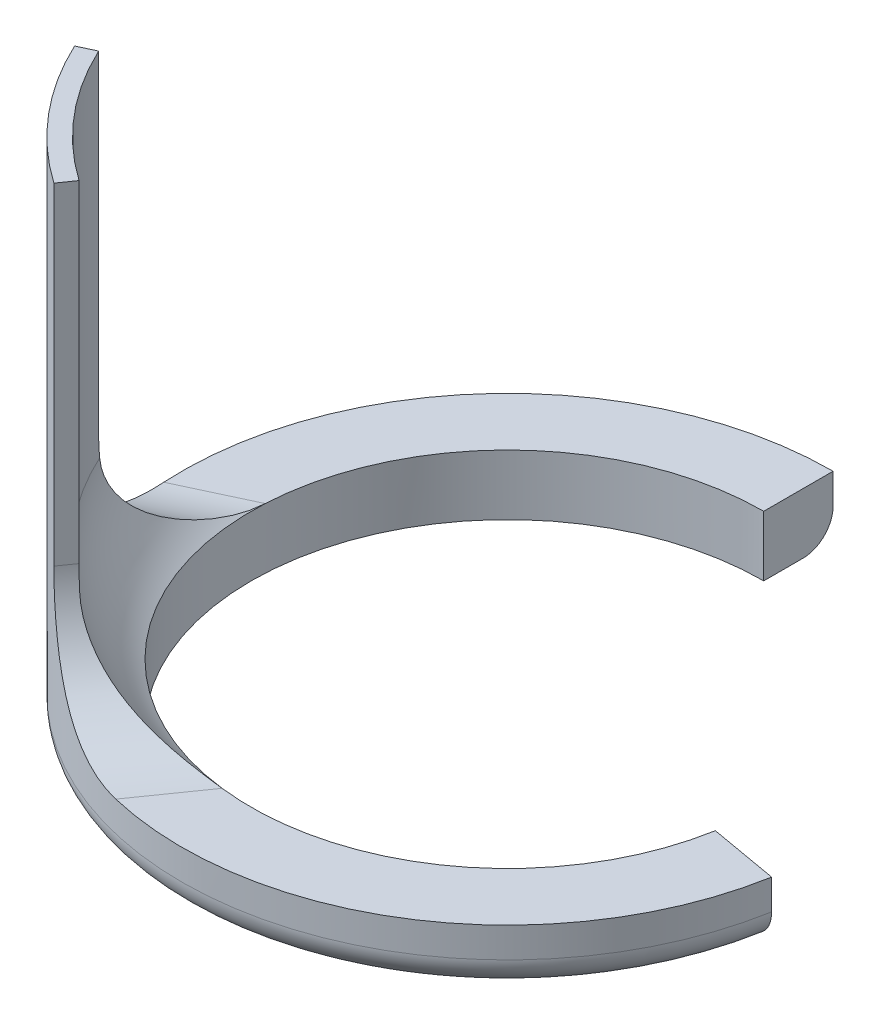
ISO-10303-21;
HEADER;
FILE_DESCRIPTION(('STEP AP214'),'2;1');
FILE_NAME('part.step','',(''),(''),'','','');
FILE_SCHEMA(('AUTOMOTIVE_DESIGN { 1 0 10303 214 1 1 1 1 }'));
ENDSEC;
DATA;
#1=APPLICATION_CONTEXT('core data for automotive mechanical design processes');
#2=APPLICATION_PROTOCOL_DEFINITION('international standard','automotive_design',2000,#1);
#3=PRODUCT_CONTEXT('',#1,'mechanical');
#4=PRODUCT('Part','Part','',(#3));
#5=PRODUCT_RELATED_PRODUCT_CATEGORY('part','',(#4));
#6=PRODUCT_DEFINITION_FORMATION('','',#4);
#7=PRODUCT_DEFINITION_CONTEXT('part definition',#1,'design');
#8=PRODUCT_DEFINITION('design','',#6,#7);
#9=PRODUCT_DEFINITION_SHAPE('','',#8);
#10=(LENGTH_UNIT() NAMED_UNIT(*) SI_UNIT(.MILLI.,.METRE.));
#11=(NAMED_UNIT(*) PLANE_ANGLE_UNIT() SI_UNIT($,.RADIAN.));
#12=(NAMED_UNIT(*) SI_UNIT($,.STERADIAN.) SOLID_ANGLE_UNIT());
#13=UNCERTAINTY_MEASURE_WITH_UNIT(LENGTH_MEASURE(1.E-05),#10,'distance_accuracy_value','');
#14=(GEOMETRIC_REPRESENTATION_CONTEXT(3) GLOBAL_UNCERTAINTY_ASSIGNED_CONTEXT((#13)) GLOBAL_UNIT_ASSIGNED_CONTEXT((#10,
#11,#12)) REPRESENTATION_CONTEXT('',''));
#15=CARTESIAN_POINT('',(0.,0.,0.));
#16=DIRECTION('',(0.,0.,1.));
#17=DIRECTION('',(1.,0.,0.));
#18=AXIS2_PLACEMENT_3D('',#15,#16,#17);
#19=CARTESIAN_POINT('',(0.,2.54,0.));
#20=DIRECTION('',(0.,1.,0.));
#21=DIRECTION('',(0.,0.,1.));
#22=AXIS2_PLACEMENT_3D('',#19,#20,#21);
#23=PLANE('',#22);
#24=CARTESIAN_POINT('',(0.,2.54,0.));
#25=DIRECTION('',(0.,1.,0.));
#26=DIRECTION('',(0.,0.,1.));
#27=AXIS2_PLACEMENT_3D('',#24,#25,#26);
#28=CIRCLE('',#27,10.795);
#29=CARTESIAN_POINT('',(-1.3020231712556,2.54,10.716191518516));
#30=VERTEX_POINT('',#29);
#31=CARTESIAN_POINT('',(10.6309996937668,2.54,1.87453207791447));
#32=VERTEX_POINT('',#31);
#33=EDGE_CURVE('E193',#30,#32,#28,.T.);
#34=ORIENTED_EDGE('',*,*,#33,.F.);
#35=DIRECTION('',(-0.573576436351044,0.,0.819152044288993));
#36=VECTOR('',#35,1.);
#37=CARTESIAN_POINT('',(-3.70588201600283,2.54,14.1492577361311));
#38=LINE('',#37,#36);
#39=CARTESIAN_POINT('',(-3.14640132568196,2.54,13.3502365034387));
#40=VERTEX_POINT('',#39);
#41=EDGE_CURVE('E224',#30,#40,#38,.T.);
#42=ORIENTED_EDGE('',*,*,#41,.T.);
#43=CARTESIAN_POINT('',(0.,2.54,0.));
#44=DIRECTION('',(0.,1.,0.));
#45=DIRECTION('',(0.,0.,1.));
#46=AXIS2_PLACEMENT_3D('',#43,#44,#45);
#47=CIRCLE('',#46,13.716);
#48=CARTESIAN_POINT('',(13.5076231403155,2.54,2.38175840487956));
#49=VERTEX_POINT('',#48);
#50=EDGE_CURVE('E183',#40,#49,#47,.T.);
#51=ORIENTED_EDGE('',*,*,#50,.T.);
#52=DIRECTION('',(0.984807753012209,0.,0.173648177666926));
#53=VECTOR('',#52,1.);
#54=CARTESIAN_POINT('',(0.,2.54,0.));
#55=LINE('',#54,#53);
#56=EDGE_CURVE('E189',#32,#49,#55,.T.);
#57=ORIENTED_EDGE('',*,*,#56,.F.);
#58=EDGE_LOOP('',(#34,#42,#51,#57));
#59=FACE_BOUND('',#58,.T.);
#60=ADVANCED_FACE('F41',(#59),#23,.T.);
#61=CARTESIAN_POINT('',(0.,2.54,-13.716));
#62=VERTEX_POINT('',#61);
#63=CARTESIAN_POINT('',(-13.6937832695465,2.54,0.780356179374884));
#64=VERTEX_POINT('',#63);
#65=EDGE_CURVE('E185',#62,#64,#47,.T.);
#66=ORIENTED_EDGE('',*,*,#65,.T.);
#67=DIRECTION('',(-0.90630778703665,0.,0.422618261740701));
#68=VECTOR('',#67,1.);
#69=CARTESIAN_POINT('',(-2.14690076964276,2.54,-4.60404355814618));
#70=LINE('',#69,#68);
#71=CARTESIAN_POINT('',(-10.7794824411668,2.54,-0.578604615066006));
#72=VERTEX_POINT('',#71);
#73=EDGE_CURVE('E221',#64,#72,#70,.F.);
#74=ORIENTED_EDGE('',*,*,#73,.T.);
#75=CARTESIAN_POINT('',(0.,2.54,-10.795));
#76=VERTEX_POINT('',#75);
#77=EDGE_CURVE('E194',#76,#72,#28,.T.);
#78=ORIENTED_EDGE('',*,*,#77,.F.);
#79=DIRECTION('',(0.,0.,1.));
#80=VECTOR('',#79,1.);
#81=CARTESIAN_POINT('',(0.,2.54,0.));
#82=LINE('',#81,#80);
#83=EDGE_CURVE('E179',#62,#76,#82,.T.);
#84=ORIENTED_EDGE('',*,*,#83,.F.);
#85=EDGE_LOOP('',(#66,#74,#78,#84));
#86=FACE_BOUND('',#85,.T.);
#87=ADVANCED_FACE('F327',(#86),#23,.T.);
#88=CARTESIAN_POINT('',(0.,2.54,0.));
#89=DIRECTION('',(1.,0.,0.));
#90=DIRECTION('',(0.,0.,-1.));
#91=AXIS2_PLACEMENT_3D('',#88,#89,#90);
#92=PLANE('',#91);
#93=DIRECTION('',(0.,0.,1.));
#94=VECTOR('',#93,1.);
#95=CARTESIAN_POINT('',(0.,0.,0.));
#96=LINE('',#95,#94);
#97=CARTESIAN_POINT('',(0.,0.,-12.446));
#98=VERTEX_POINT('',#97);
#99=CARTESIAN_POINT('',(0.,0.,-10.795));
#100=VERTEX_POINT('',#99);
#101=EDGE_CURVE('E143',#98,#100,#96,.T.);
#102=ORIENTED_EDGE('',*,*,#101,.F.);
#103=CARTESIAN_POINT('',(0.,1.27,-12.446));
#104=DIRECTION('',(1.,0.,0.));
#105=DIRECTION('',(0.,0.,-1.));
#106=AXIS2_PLACEMENT_3D('',#103,#104,#105);
#107=CIRCLE('',#106,1.27);
#108=CARTESIAN_POINT('',(0.,1.27,-13.716));
#109=VERTEX_POINT('',#108);
#110=EDGE_CURVE('E11',#98,#109,#107,.T.);
#111=ORIENTED_EDGE('',*,*,#110,.T.);
#112=DIRECTION('',(0.,-1.,0.));
#113=VECTOR('',#112,1.);
#114=CARTESIAN_POINT('',(0.,2.54,-13.716));
#115=LINE('',#114,#113);
#116=EDGE_CURVE('E217',#62,#109,#115,.T.);
#117=ORIENTED_EDGE('',*,*,#116,.F.);
#118=ORIENTED_EDGE('',*,*,#83,.T.);
#119=DIRECTION('',(0.,-1.,0.));
#120=VECTOR('',#119,1.);
#121=CARTESIAN_POINT('',(0.,2.54,-10.795));
#122=LINE('',#121,#120);
#123=EDGE_CURVE('E198',#76,#100,#122,.T.);
#124=ORIENTED_EDGE('',*,*,#123,.T.);
#125=EDGE_LOOP('',(#102,#111,#117,#118,#124));
#126=FACE_BOUND('',#125,.T.);
#127=ADVANCED_FACE('F329',(#126),#92,.T.);
#128=CARTESIAN_POINT('',(0.,2.54,0.));
#129=DIRECTION('',(0.,-1.,0.));
#130=DIRECTION('',(0.,0.,-1.));
#131=AXIS2_PLACEMENT_3D('',#128,#129,#130);
#132=CYLINDRICAL_SURFACE('',#131,13.716);
#133=ORIENTED_EDGE('',*,*,#116,.T.);
#134=CARTESIAN_POINT('',(0.,1.27,0.));
#135=DIRECTION('',(0.,1.,0.));
#136=DIRECTION('',(0.,0.,1.));
#137=AXIS2_PLACEMENT_3D('',#134,#135,#136);
#138=CIRCLE('',#137,13.716);
#139=CARTESIAN_POINT('',(13.5076231403155,1.27,2.38175840487956));
#140=VERTEX_POINT('',#139);
#141=EDGE_CURVE('E285',#109,#140,#138,.T.);
#142=ORIENTED_EDGE('',*,*,#141,.T.);
#143=DIRECTION('',(0.,-1.,0.));
#144=VECTOR('',#143,1.);
#145=CARTESIAN_POINT('',(13.5076231403155,2.54,2.38175840487956));
#146=LINE('',#145,#144);
#147=EDGE_CURVE('E214',#49,#140,#146,.T.);
#148=ORIENTED_EDGE('',*,*,#147,.F.);
#149=ORIENTED_EDGE('',*,*,#50,.F.);
#150=CARTESIAN_POINT('',(-3.14640132568196,2.54,13.3502365034387));
#151=CARTESIAN_POINT('',(-3.28459486417122,2.53998377497949,13.3176867125677));
#152=CARTESIAN_POINT('',(-3.42229902989886,2.54513485361212,13.2829484443979));
#153=CARTESIAN_POINT('',(-3.69585990877262,2.5660515861756,13.2094360693826));
#154=CARTESIAN_POINT('',(-3.83171594525099,2.58182102654611,13.1706605270422));
#155=CARTESIAN_POINT('',(-4.10065538906891,2.62426171466832,13.0894253265799));
#156=CARTESIAN_POINT('',(-4.23373788616767,2.6509364839923,13.0469644818844));
#157=CARTESIAN_POINT('',(-4.49611929217794,2.71531898731794,12.9588851994727));
#158=CARTESIAN_POINT('',(-4.62541873000943,2.75302517080024,12.9132672061967));
#159=CARTESIAN_POINT('',(-4.8796590219347,2.83959296510776,12.819360352511));
#160=CARTESIAN_POINT('',(-5.00458743838185,2.88848382826193,12.7710647445811));
#161=CARTESIAN_POINT('',(-5.2488287789317,2.99722266021862,12.6726393858319));
#162=CARTESIAN_POINT('',(-5.36814173551235,3.05707056563947,12.6225096456236));
#163=CARTESIAN_POINT('',(-5.60022849545585,3.18737755197283,12.5212664924808));
#164=CARTESIAN_POINT('',(-5.71300791895925,3.25782731966913,12.4701539769026));
#165=CARTESIAN_POINT('',(-5.93140990930209,3.40894934233038,12.3677637587145));
#166=CARTESIAN_POINT('',(-6.03703274308743,3.489621215681,12.3164860623408));
#167=CARTESIAN_POINT('',(-6.23701125313301,3.65770627969682,12.2163996802899));
#168=CARTESIAN_POINT('',(-6.33162908995121,3.74479345173442,12.1675666251489));
#169=CARTESIAN_POINT('',(-6.51318153267663,3.92744121784043,12.0713579399569));
#170=CARTESIAN_POINT('',(-6.6001135430935,4.02300465266927,12.0239828057377));
#171=CARTESIAN_POINT('',(-6.76588817393649,4.22193262216814,11.9314888472259));
#172=CARTESIAN_POINT('',(-6.84473019350175,4.32529773529733,11.8863701906541));
#173=CARTESIAN_POINT('',(-6.99405078113878,4.53915154929731,11.7991267460904));
#174=CARTESIAN_POINT('',(-7.06452622983585,4.64964288354637,11.7570030770764));
#175=CARTESIAN_POINT('',(-7.19764350270112,4.87831643135601,11.6759894642624));
#176=CARTESIAN_POINT('',(-7.26018189742154,4.9965746416305,11.6371440690586));
#177=CARTESIAN_POINT('',(-7.37627491806676,5.2388003436095,11.5639066806752));
#178=CARTESIAN_POINT('',(-7.42982607359874,5.36277001733406,11.5295164089908));
#179=CARTESIAN_POINT('',(-7.52775876468983,5.61545963551204,11.4658152867966));
#180=CARTESIAN_POINT('',(-7.5721458000828,5.74417667584365,11.4365013914198));
#181=CARTESIAN_POINT('',(-7.65170466527322,6.00555021950874,11.3834241343753));
#182=CARTESIAN_POINT('',(-7.68687385534494,6.13820783922862,11.359662362887));
#183=CARTESIAN_POINT('',(-7.76725747992021,6.49164635030602,11.3049592380657));
#184=CARTESIAN_POINT('',(-7.80474142222789,6.71506124918966,11.2789924461242));
#185=CARTESIAN_POINT('',(-7.8422051292145,7.05295823236614,11.2529403786467));
#186=CARTESIAN_POINT('',(-7.85156599881339,7.16604124236626,11.2464060519228));
#187=CARTESIAN_POINT('',(-7.86404853913686,7.39273452808754,11.2376790682754));
#188=CARTESIAN_POINT('',(-7.86716930836712,7.50634487761637,11.235487038675));
#189=CARTESIAN_POINT('',(-7.86717440099092,7.62,11.2354894394678));
#190=B_SPLINE_CURVE_WITH_KNOTS('',3,(#150,#151,#152,#153,#154,#155,#156,#157,#158,#159,#160,
#161,#162,#163,#164,#165,#166,#167,#168,#169,#170,#171,#172,#173,#174,#175,#176,#177,#178,#179,
#180,#181,#182,#183,#184,#185,#186,#187,#188,#189),.UNSPECIFIED.,.F.,.F.,(4,2,2,2,2,2,2,2,2,2,2,
2,2,2,2,2,2,2,2,4),(0.,0.425852141959941,0.851856220538034,1.27799797406688,1.70407986003497,
2.13128912215917,2.55849591314415,2.98532959121032,3.41214733930103,3.82432934902149,
4.23665002443401,4.6490013016485,5.06150583939957,5.47892912394067,5.89651322607559,
6.31384598249095,6.73129812074459,7.41296385335493,7.75372672925054,8.09453883089436),.UNSPECIFIED.);
#191=CARTESIAN_POINT('',(-7.86717440099092,7.62,11.2354894394678));
#192=VERTEX_POINT('',#191);
#193=EDGE_CURVE('E237',#40,#192,#190,.T.);
#194=ORIENTED_EDGE('',*,*,#193,.T.);
#195=DIRECTION('',(0.,-1.,0.));
#196=VECTOR('',#195,1.);
#197=CARTESIAN_POINT('',(-7.86717440099092,21.59,11.2354894394678));
#198=LINE('',#197,#196);
#199=CARTESIAN_POINT('',(-7.86717440099092,21.59,11.2354894394678));
#200=VERTEX_POINT('',#199);
#201=EDGE_CURVE('E173',#200,#192,#198,.T.);
#202=ORIENTED_EDGE('',*,*,#201,.F.);
#203=CARTESIAN_POINT('',(0.,21.59,0.));
#204=DIRECTION('',(0.,1.,0.));
#205=DIRECTION('',(0.,0.,1.));
#206=AXIS2_PLACEMENT_3D('',#203,#204,#205);
#207=CIRCLE('',#206,13.716);
#208=CARTESIAN_POINT('',(-12.4309176069947,21.59,5.79663207803545));
#209=VERTEX_POINT('',#208);
#210=EDGE_CURVE('E153',#209,#200,#207,.T.);
#211=ORIENTED_EDGE('',*,*,#210,.F.);
#212=DIRECTION('',(0.,-1.,0.));
#213=VECTOR('',#212,1.);
#214=CARTESIAN_POINT('',(-12.4309176069947,21.59,5.79663207803545));
#215=LINE('',#214,#213);
#216=CARTESIAN_POINT('',(-12.4309176069947,7.62,5.79663207803545));
#217=VERTEX_POINT('',#216);
#218=EDGE_CURVE('E144',#209,#217,#215,.T.);
#219=ORIENTED_EDGE('',*,*,#218,.T.);
#220=CARTESIAN_POINT('',(-12.4309176069947,7.62,5.79663207803545));
#221=CARTESIAN_POINT('',(-12.4308959867399,7.47731386001434,5.79663885682485));
#222=CARTESIAN_POINT('',(-12.4334574782522,7.33462989846825,5.79118406296373));
#223=CARTESIAN_POINT('',(-12.443590488637,7.05027928699504,5.76940019938703));
#224=CARTESIAN_POINT('',(-12.4511617960775,6.90861259439061,5.75307158858486));
#225=CARTESIAN_POINT('',(-12.4711531418719,6.62736935939024,5.70960009688164));
#226=CARTESIAN_POINT('',(-12.483570692927,6.48779178286758,5.68246276333124));
#227=CARTESIAN_POINT('',(-12.5129511569366,6.21164401218113,5.61747172389063));
#228=CARTESIAN_POINT('',(-12.5299140139069,6.07507378099853,5.57961814999121));
#229=CARTESIAN_POINT('',(-12.5679898674745,5.80585847729285,5.49331482903529));
#230=CARTESIAN_POINT('',(-12.5891044540235,5.67321493099926,5.44486102169667));
#231=CARTESIAN_POINT('',(-12.6349843482706,5.41280800782531,5.33753055417389));
#232=CARTESIAN_POINT('',(-12.6597510033795,5.2850464541291,5.27865004549748));
#233=CARTESIAN_POINT('',(-12.7123250766159,5.03543976333176,5.15074971646765));
#234=CARTESIAN_POINT('',(-12.7401309601019,4.91359168472832,5.08173500733142));
#235=CARTESIAN_POINT('',(-12.7981394040462,4.67658926161054,4.93382143297201));
#236=CARTESIAN_POINT('',(-12.8283427823418,4.56143722466966,4.85491918954004));
#237=CARTESIAN_POINT('',(-12.8902321930909,4.33936968751641,4.68811625734257));
#238=CARTESIAN_POINT('',(-12.9219085534099,4.23241007586982,4.60027072040132));
#239=CARTESIAN_POINT('',(-12.9861510660066,4.02677410769305,4.41566354960587));
#240=CARTESIAN_POINT('',(-13.0187171966151,3.92809754967769,4.31890213275051));
#241=CARTESIAN_POINT('',(-13.0839583052927,3.73975695005625,4.11703027882474));
#242=CARTESIAN_POINT('',(-13.1166332679916,3.65009168727375,4.01192097649356));
#243=CARTESIAN_POINT('',(-13.1813054787773,3.48042787544491,3.79404095513771));
#244=CARTESIAN_POINT('',(-13.2133029807772,3.40042564982372,3.68127317567191));
#245=CARTESIAN_POINT('',(-13.2751625290167,3.25229453151827,3.45145607717507));
#246=CARTESIAN_POINT('',(-13.3050566312827,3.18393650040465,3.33456301540049));
#247=CARTESIAN_POINT('',(-13.3628140198068,3.05733770931259,3.09500142857709));
#248=CARTESIAN_POINT('',(-13.3906780466497,2.99909324900165,2.97233503683036));
#249=CARTESIAN_POINT('',(-13.4438031928444,2.89292783703382,2.72198148040705));
#250=CARTESIAN_POINT('',(-13.4690628569523,2.84501264094042,2.59429156318874));
#251=CARTESIAN_POINT('',(-13.5164395404959,2.75968980246474,2.3349359978324));
#252=CARTESIAN_POINT('',(-13.5385570128152,2.72228064508829,2.20327092595628));
#253=CARTESIAN_POINT('',(-13.5909392874081,2.63945286944221,1.86009607659458));
#254=CARTESIAN_POINT('',(-13.618570581185,2.60180862284266,1.64623068612271));
#255=CARTESIAN_POINT('',(-13.65249125685,2.56452023662593,1.3228521283392));
#256=CARTESIAN_POINT('',(-13.6625393116114,2.55528687242779,1.2147067162815));
#257=CARTESIAN_POINT('',(-13.6800861578112,2.54302811360786,0.997861122046878));
#258=CARTESIAN_POINT('',(-13.6875850445455,2.54000248690018,0.88916096076244));
#259=CARTESIAN_POINT('',(-13.6937832695465,2.54,0.780356179374885));
#260=B_SPLINE_CURVE_WITH_KNOTS('',3,(#220,#221,#222,#223,#224,#225,#226,#227,#228,#229,#230,
#231,#232,#233,#234,#235,#236,#237,#238,#239,#240,#241,#242,#243,#244,#245,#246,#247,#248,#249,
#250,#251,#252,#253,#254,#255,#256,#257,#258,#259),.UNSPECIFIED.,.F.,.F.,(4,2,2,2,2,2,2,2,2,2,2,
2,2,2,2,2,2,2,2,4),(0.,0.427928148805985,0.855838238679553,1.28352899506334,1.71121448385429,
2.13906407975581,2.56707192522453,2.99486464028779,3.42280391702595,3.84824791569637,
4.27368156244595,4.69905747808504,5.12427103420852,5.53978895637425,5.9551545278804,
6.37075095017011,6.78628741172249,7.44089270204662,7.7677326217032,8.09456032172044),.UNSPECIFIED.);
#261=EDGE_CURVE('E293',#217,#64,#260,.T.);
#262=ORIENTED_EDGE('',*,*,#261,.T.);
#263=ORIENTED_EDGE('',*,*,#65,.F.);
#264=EDGE_LOOP('',(#133,#142,#148,#149,#194,#202,#211,#219,#262,#263));
#265=FACE_BOUND('',#264,.T.);
#266=ADVANCED_FACE('F253',(#265),#132,.T.);
#267=CARTESIAN_POINT('',(0.,2.54,0.));
#268=DIRECTION('',(0.173648177666926,0.,-0.984807753012209));
#269=DIRECTION('',(-0.984807753012209,0.,-0.173648177666926));
#270=AXIS2_PLACEMENT_3D('',#267,#268,#269);
#271=PLANE('',#270);
#272=ORIENTED_EDGE('',*,*,#147,.T.);
#273=CARTESIAN_POINT('',(12.25691729399,1.27,2.16122521924257));
#274=DIRECTION('',(0.173648177666926,0.,-0.984807753012209));
#275=DIRECTION('',(-0.984807753012209,0.,-0.173648177666926));
#276=AXIS2_PLACEMENT_3D('',#273,#274,#275);
#277=CIRCLE('',#276,1.27);
#278=CARTESIAN_POINT('',(12.25691729399,0.,2.16122521924257));
#279=VERTEX_POINT('',#278);
#280=EDGE_CURVE('E64',#140,#279,#277,.T.);
#281=ORIENTED_EDGE('',*,*,#280,.T.);
#282=DIRECTION('',(0.984807753012209,0.,0.173648177666926));
#283=VECTOR('',#282,1.);
#284=CARTESIAN_POINT('',(0.,0.,0.));
#285=LINE('',#284,#283);
#286=CARTESIAN_POINT('',(10.6309996937668,0.,1.87453207791447));
#287=VERTEX_POINT('',#286);
#288=EDGE_CURVE('E202',#287,#279,#285,.T.);
#289=ORIENTED_EDGE('',*,*,#288,.F.);
#290=DIRECTION('',(0.,-1.,0.));
#291=VECTOR('',#290,1.);
#292=CARTESIAN_POINT('',(10.6309996937668,2.54,1.87453207791447));
#293=LINE('',#292,#291);
#294=EDGE_CURVE('E211',#32,#287,#293,.T.);
#295=ORIENTED_EDGE('',*,*,#294,.F.);
#296=ORIENTED_EDGE('',*,*,#56,.T.);
#297=EDGE_LOOP('',(#272,#281,#289,#295,#296));
#298=FACE_BOUND('',#297,.T.);
#299=ADVANCED_FACE('F307',(#298),#271,.T.);
#300=CARTESIAN_POINT('',(0.,2.54,0.));
#301=DIRECTION('',(0.,-1.,0.));
#302=DIRECTION('',(0.,0.,-1.));
#303=AXIS2_PLACEMENT_3D('',#300,#301,#302);
#304=CYLINDRICAL_SURFACE('',#303,10.795);
#305=CARTESIAN_POINT('',(0.,0.,0.));
#306=DIRECTION('',(0.,1.,0.));
#307=DIRECTION('',(0.,0.,1.));
#308=AXIS2_PLACEMENT_3D('',#305,#306,#307);
#309=CIRCLE('',#308,10.795);
#310=EDGE_CURVE('E184',#100,#287,#309,.T.);
#311=ORIENTED_EDGE('',*,*,#310,.F.);
#312=ORIENTED_EDGE('',*,*,#123,.F.);
#313=ORIENTED_EDGE('',*,*,#77,.T.);
#314=EDGE_CURVE('E199',#72,#30,#28,.T.);
#315=ORIENTED_EDGE('',*,*,#314,.T.);
#316=ORIENTED_EDGE('',*,*,#33,.T.);
#317=ORIENTED_EDGE('',*,*,#294,.T.);
#318=EDGE_LOOP('',(#311,#312,#313,#315,#316,#317));
#319=FACE_BOUND('',#318,.T.);
#320=ADVANCED_FACE('F310',(#319),#304,.F.);
#321=CARTESIAN_POINT('',(0.,0.,0.));
#322=DIRECTION('',(0.,1.,0.));
#323=DIRECTION('',(0.,0.,1.));
#324=AXIS2_PLACEMENT_3D('',#321,#322,#323);
#325=PLANE('',#324);
#326=ORIENTED_EDGE('',*,*,#288,.T.);
#327=CARTESIAN_POINT('',(0.,0.,0.));
#328=DIRECTION('',(0.,1.,0.));
#329=DIRECTION('',(0.,0.,1.));
#330=AXIS2_PLACEMENT_3D('',#327,#328,#329);
#331=CIRCLE('',#330,12.446);
#332=EDGE_CURVE('E50',#279,#98,#331,.F.);
#333=ORIENTED_EDGE('',*,*,#332,.T.);
#334=ORIENTED_EDGE('',*,*,#101,.T.);
#335=ORIENTED_EDGE('',*,*,#310,.T.);
#336=EDGE_LOOP('',(#326,#333,#334,#335));
#337=FACE_BOUND('',#336,.T.);
#338=ADVANCED_FACE('F343',(#337),#325,.F.);
#339=CARTESIAN_POINT('',(0.,21.59,0.));
#340=DIRECTION('',(0.,-1.,0.));
#341=DIRECTION('',(0.,0.,-1.));
#342=AXIS2_PLACEMENT_3D('',#339,#340,#341);
#343=CYLINDRICAL_SURFACE('',#342,12.954);
#344=CARTESIAN_POINT('',(-7.43010915649142,7.62,10.6112955817196));
#345=CARTESIAN_POINT('',(-7.43010933513072,7.54250667316764,10.6112936856739));
#346=CARTESIAN_POINT('',(-7.42865664257929,7.46501345988073,10.612312644186));
#347=CARTESIAN_POINT('',(-7.42285292086023,7.31035070008687,10.6163737882854));
#348=CARTESIAN_POINT('',(-7.41850794192512,7.23318081561497,10.6194117503964));
#349=CARTESIAN_POINT('',(-7.40692703000021,7.07916360894416,10.6274925392457));
#350=CARTESIAN_POINT('',(-7.39969109696496,7.00231628675032,10.6325353660156));
#351=CARTESIAN_POINT('',(-7.3823131990965,6.8489441390725,10.6446076037212));
#352=CARTESIAN_POINT('',(-7.37216519320524,6.77242032307278,10.6516411439471));
#353=CARTESIAN_POINT('',(-7.36056873920647,6.69621931567621,10.6596502679692));
#354=B_SPLINE_CURVE_WITH_KNOTS('',3,(#344,#345,#346,#347,#348,#349,#350,#351,#352,#353),
.UNSPECIFIED.,.F.,.F.,(4,2,2,2,4),(0.,0.232459486824841,0.464434224745985,0.696408966314585,
0.928868459178327),.UNSPECIFIED.);
#355=CARTESIAN_POINT('',(-7.43010915649142,7.62,10.6112955817196));
#356=VERTEX_POINT('',#355);
#357=CARTESIAN_POINT('',(-7.36056873920647,6.69621931567621,10.6596502679692));
#358=VERTEX_POINT('',#357);
#359=EDGE_CURVE('E246',#356,#358,#354,.T.);
#360=ORIENTED_EDGE('',*,*,#359,.T.);
#361=CARTESIAN_POINT('',(0.,6.69621931567621,0.));
#362=DIRECTION('',(0.,-1.,0.));
#363=DIRECTION('',(0.,0.,-1.));
#364=AXIS2_PLACEMENT_3D('',#361,#362,#363);
#365=CIRCLE('',#364,12.954);
#366=CARTESIAN_POINT('',(-11.7758555764501,6.69621931567621,5.39771631735021));
#367=VERTEX_POINT('',#366);
#368=EDGE_CURVE('E234',#358,#367,#365,.T.);
#369=ORIENTED_EDGE('',*,*,#368,.T.);
#370=CARTESIAN_POINT('',(-11.7758555764501,6.69621931567621,5.39771631735021));
#371=CARTESIAN_POINT('',(-11.7699818321225,6.77242032307278,5.4105273649468));
#372=CARTESIAN_POINT('',(-11.7648173299069,6.8489441390725,5.42174256126891));
#373=CARTESIAN_POINT('',(-11.7559461369148,7.00231628675032,5.44095277189876));
#374=CARTESIAN_POINT('',(-11.7522364286,7.07916360894416,5.44895445253103));
#375=CARTESIAN_POINT('',(-11.7462894093422,7.23318081561497,5.46176263863943));
#376=CARTESIAN_POINT('',(-11.744052098376,7.31035070008687,5.46656914416579));
#377=CARTESIAN_POINT('',(-11.7410604578811,7.46501345988073,5.47298990458315));
#378=CARTESIAN_POINT('',(-11.7403092370526,7.54250667316764,5.47459746775929));
#379=CARTESIAN_POINT('',(-11.7403110732728,7.62,5.47459696258904));
#380=B_SPLINE_CURVE_WITH_KNOTS('',3,(#370,#371,#372,#373,#374,#375,#376,#377,#378,#379),
.UNSPECIFIED.,.F.,.F.,(4,2,2,2,4),(0.,0.232459492863741,0.464434234432342,0.696408972353486,
0.928868459178327),.UNSPECIFIED.);
#381=CARTESIAN_POINT('',(-11.7403110732728,7.62,5.47459696258904));
#382=VERTEX_POINT('',#381);
#383=EDGE_CURVE('E139',#367,#382,#380,.T.);
#384=ORIENTED_EDGE('',*,*,#383,.T.);
#385=DIRECTION('',(0.,-1.,0.));
#386=VECTOR('',#385,1.);
#387=CARTESIAN_POINT('',(-11.7403110732728,21.59,5.47459696258904));
#388=LINE('',#387,#386);
#389=CARTESIAN_POINT('',(-11.7403110732728,21.59,5.47459696258904));
#390=VERTEX_POINT('',#389);
#391=EDGE_CURVE('E130',#390,#382,#388,.T.);
#392=ORIENTED_EDGE('',*,*,#391,.F.);
#393=CARTESIAN_POINT('',(0.,21.59,0.));
#394=DIRECTION('',(0.,1.,0.));
#395=DIRECTION('',(0.,0.,1.));
#396=AXIS2_PLACEMENT_3D('',#393,#394,#395);
#397=CIRCLE('',#396,12.954);
#398=CARTESIAN_POINT('',(-7.43010915649142,21.59,10.6112955817196));
#399=VERTEX_POINT('',#398);
#400=EDGE_CURVE('E136',#390,#399,#397,.T.);
#401=ORIENTED_EDGE('',*,*,#400,.T.);
#402=DIRECTION('',(0.,-1.,0.));
#403=VECTOR('',#402,1.);
#404=CARTESIAN_POINT('',(-7.43010915649142,21.59,10.6112955817196));
#405=LINE('',#404,#403);
#406=EDGE_CURVE('E170',#399,#356,#405,.T.);
#407=ORIENTED_EDGE('',*,*,#406,.T.);
#408=EDGE_LOOP('',(#360,#369,#384,#392,#401,#407));
#409=FACE_BOUND('',#408,.T.);
#410=ADVANCED_FACE('F133',(#409),#343,.F.);
#411=CARTESIAN_POINT('',(0.,21.59,0.));
#412=DIRECTION('',(0.422618261740701,0.,0.906307787036649));
#413=DIRECTION('',(0.90630778703665,0.,-0.422618261740701));
#414=AXIS2_PLACEMENT_3D('',#411,#412,#413);
#415=PLANE('',#414);
#416=ORIENTED_EDGE('',*,*,#391,.T.);
#417=DIRECTION('',(-0.90630778703665,0.,0.422618261740701));
#418=VECTOR('',#417,1.);
#419=CARTESIAN_POINT('',(0.,7.62,0.));
#420=LINE('',#419,#418);
#421=EDGE_CURVE('E231',#382,#217,#420,.T.);
#422=ORIENTED_EDGE('',*,*,#421,.T.);
#423=ORIENTED_EDGE('',*,*,#218,.F.);
#424=DIRECTION('',(-0.906307787036649,0.,0.422618261740701));
#425=VECTOR('',#424,1.);
#426=CARTESIAN_POINT('',(0.,21.59,0.));
#427=LINE('',#426,#425);
#428=EDGE_CURVE('E147',#390,#209,#427,.T.);
#429=ORIENTED_EDGE('',*,*,#428,.F.);
#430=EDGE_LOOP('',(#416,#422,#423,#429));
#431=FACE_BOUND('',#430,.T.);
#432=ADVANCED_FACE('F148',(#431),#415,.F.);
#433=CARTESIAN_POINT('',(0.,21.59,0.));
#434=DIRECTION('',(0.819152044288993,0.,0.573576436351044));
#435=DIRECTION('',(0.573576436351044,0.,-0.819152044288993));
#436=AXIS2_PLACEMENT_3D('',#433,#434,#435);
#437=PLANE('',#436);
#438=ORIENTED_EDGE('',*,*,#201,.T.);
#439=DIRECTION('',(-0.573576436351044,0.,0.819152044288993));
#440=VECTOR('',#439,1.);
#441=CARTESIAN_POINT('',(-7.43010915649142,7.62,10.6112955817196));
#442=LINE('',#441,#440);
#443=EDGE_CURVE('E228',#192,#356,#442,.F.);
#444=ORIENTED_EDGE('',*,*,#443,.T.);
#445=ORIENTED_EDGE('',*,*,#406,.F.);
#446=DIRECTION('',(-0.573576436351044,0.,0.819152044288993));
#447=VECTOR('',#446,1.);
#448=CARTESIAN_POINT('',(0.,21.59,0.));
#449=LINE('',#448,#447);
#450=EDGE_CURVE('E157',#399,#200,#449,.T.);
#451=ORIENTED_EDGE('',*,*,#450,.T.);
#452=EDGE_LOOP('',(#438,#444,#445,#451));
#453=FACE_BOUND('',#452,.T.);
#454=ADVANCED_FACE('F320',(#453),#437,.T.);
#455=CARTESIAN_POINT('',(0.,21.59,0.));
#456=DIRECTION('',(0.,1.,0.));
#457=DIRECTION('',(0.,0.,1.));
#458=AXIS2_PLACEMENT_3D('',#455,#456,#457);
#459=PLANE('',#458);
#460=ORIENTED_EDGE('',*,*,#400,.F.);
#461=ORIENTED_EDGE('',*,*,#428,.T.);
#462=ORIENTED_EDGE('',*,*,#210,.T.);
#463=ORIENTED_EDGE('',*,*,#450,.F.);
#464=EDGE_LOOP('',(#460,#461,#462,#463));
#465=FACE_BOUND('',#464,.T.);
#466=ADVANCED_FACE('F155',(#465),#459,.T.);
#467=CARTESIAN_POINT('',(-2.14690076964276,7.62,-4.60404355814618));
#468=DIRECTION('',(-0.90630778703665,0.,0.422618261740701));
#469=DIRECTION('',(0.422618261740701,0.,0.906307787036649));
#470=AXIS2_PLACEMENT_3D('',#467,#468,#469);
#471=CYLINDRICAL_SURFACE('',#470,5.08);
#472=ORIENTED_EDGE('',*,*,#421,.F.);
#473=ORIENTED_EDGE('',*,*,#383,.F.);
#474=CARTESIAN_POINT('',(-10.7794824411668,2.54,-0.578604615066008));
#475=CARTESIAN_POINT('',(-10.7852872473457,2.54000951446605,-0.470230428874661));
#476=CARTESIAN_POINT('',(-10.7933286951301,2.54270792202633,-0.362016653499755));
#477=CARTESIAN_POINT('',(-10.8132389133927,2.55318260726561,-0.146257932064045));
#478=CARTESIAN_POINT('',(-10.825105050062,2.56095539432323,-0.0387125775039421));
#479=CARTESIAN_POINT('',(-10.8520037148939,2.58126110150131,0.175314408226647));
#480=CARTESIAN_POINT('',(-10.8670303918503,2.59378525922963,0.281797629392275));
#481=CARTESIAN_POINT('',(-10.8996233023204,2.62338830615522,0.493746249560199));
#482=CARTESIAN_POINT('',(-10.91719003442,2.64046809013085,0.599211444388979));
#483=CARTESIAN_POINT('',(-10.9731243791233,2.69866498685648,0.915814497896888));
#484=CARTESIAN_POINT('',(-11.0144605015535,2.74655050358495,1.12521672978961));
#485=CARTESIAN_POINT('',(-11.1007908880283,2.85983412238661,1.53851981262833));
#486=CARTESIAN_POINT('',(-11.1457869025772,2.92524063935632,1.74241796817185));
#487=CARTESIAN_POINT('',(-11.2302723498822,3.06411869101704,2.11712821122879));
#488=CARTESIAN_POINT('',(-11.269707568564,3.13539766288172,2.28876445613468));
#489=CARTESIAN_POINT('',(-11.3472428991937,3.29187968816263,2.62587546613075));
#490=CARTESIAN_POINT('',(-11.3853432660724,3.37708006506142,2.79135140810152));
#491=CARTESIAN_POINT('',(-11.4586625626198,3.5616196963786,3.11404924315008));
#492=CARTESIAN_POINT('',(-11.4938923087769,3.66090160482653,3.27130123667862));
#493=CARTESIAN_POINT('',(-11.5603827960144,3.8742881545837,3.57621703209541));
#494=CARTESIAN_POINT('',(-11.5916453472154,3.98838598736813,3.72388519168508));
#495=CARTESIAN_POINT('',(-11.6584781115748,4.27169440329136,4.05379333812897));
#496=CARTESIAN_POINT('',(-11.6921099972396,4.44672157665624,4.23153270487947));
#497=CARTESIAN_POINT('',(-11.7477271668262,4.82303139499054,4.55898568832477));
#498=CARTESIAN_POINT('',(-11.7697188028595,5.02429964524804,4.70871456150716));
#499=CARTESIAN_POINT('',(-11.7974637366382,5.4206320500963,4.95386362476384));
#500=CARTESIAN_POINT('',(-11.8050546658332,5.61264323453609,5.05394654395607));
#501=CARTESIAN_POINT('',(-11.8075301712302,5.91041982728833,5.18031071868605));
#502=CARTESIAN_POINT('',(-11.8068733866722,6.01123913115871,5.21845560688672));
#503=CARTESIAN_POINT('',(-11.8024623038249,6.21556454747099,5.28640322031493));
#504=CARTESIAN_POINT('',(-11.7987098999234,6.31906897921838,5.31621103254537));
#505=CARTESIAN_POINT('',(-11.7910403893171,6.46867099516117,5.35264018486199));
#506=CARTESIAN_POINT('',(-11.7884263083359,6.51399815940014,5.36281747531479));
#507=CARTESIAN_POINT('',(-11.782594917633,6.60491562573618,5.38151223739401));
#508=CARTESIAN_POINT('',(-11.7793781091869,6.65050567887387,5.39003107640047));
#509=CARTESIAN_POINT('',(-11.7758555764501,6.69621931567621,5.39771631735021));
#510=B_SPLINE_CURVE_WITH_KNOTS('',3,(#474,#475,#476,#477,#478,#479,#480,#481,#482,#483,#484,
#485,#486,#487,#488,#489,#490,#491,#492,#493,#494,#495,#496,#497,#498,#499,#500,#501,#502,#503,
#504,#505,#506,#507,#508,#509),.UNSPECIFIED.,.F.,.F.,(4,2,2,2,2,2,2,2,2,2,2,2,2,2,2,2,2,4),(0.,
0.325473393124329,0.65072313151868,0.975375943235205,1.30009256758179,1.95541324765913,
2.6110492278464,3.18044346420861,3.74972835785229,4.31675811713968,4.88352821909921,
5.63577464919165,6.38761015231691,7.03453885217212,7.35759876174366,7.68046111886284,
7.82002088243861,7.95946508819964),.UNSPECIFIED.);
#511=EDGE_CURVE('E159',#72,#367,#510,.T.);
#512=ORIENTED_EDGE('',*,*,#511,.F.);
#513=ORIENTED_EDGE('',*,*,#73,.F.);
#514=ORIENTED_EDGE('',*,*,#261,.F.);
#515=EDGE_LOOP('',(#472,#473,#512,#513,#514));
#516=FACE_BOUND('',#515,.T.);
#517=ADVANCED_FACE('F264',(#516),#471,.F.);
#518=CARTESIAN_POINT('',(0.,6.69621931567621,0.));
#519=DIRECTION('',(0.,-1.,0.));
#520=DIRECTION('',(0.,0.,-1.));
#521=AXIS2_PLACEMENT_3D('',#518,#519,#520);
#522=TOROIDAL_SURFACE('',#521,7.874,5.08);
#523=ORIENTED_EDGE('',*,*,#368,.F.);
#524=CARTESIAN_POINT('',(-7.36056873920647,6.69621931567621,10.6596502679692));
#525=CARTESIAN_POINT('',(-7.3432048731176,6.58187576705302,10.6716660400456));
#526=CARTESIAN_POINT('',(-7.32030151407144,6.46830226449731,10.6827025032876));
#527=CARTESIAN_POINT('',(-7.26396385859455,6.24372617902901,10.7028608160972));
#528=CARTESIAN_POINT('',(-7.23053884169515,6.13272142287638,10.7119843410045));
#529=CARTESIAN_POINT('',(-7.15397672635661,5.91497157836106,10.7283170491867));
#530=CARTESIAN_POINT('',(-7.11091832742293,5.80819979384902,10.7355407669994));
#531=CARTESIAN_POINT('',(-7.01562825299517,5.59871332603681,10.7482383976473));
#532=CARTESIAN_POINT('',(-6.96339493192376,5.49599937458821,10.7537119960907));
#533=CARTESIAN_POINT('',(-6.8507236569626,5.29559249304137,10.7629727857526));
#534=CARTESIAN_POINT('',(-6.79031581011016,5.19788287164105,10.7667659566387));
#535=CARTESIAN_POINT('',(-6.66193685612427,5.00749094317745,10.7727888949877));
#536=CARTESIAN_POINT('',(-6.59396282231075,4.91481060225623,10.7750180550227));
#537=CARTESIAN_POINT('',(-6.37973954476134,4.64460481628902,10.7795168530765));
#538=CARTESIAN_POINT('',(-6.22327803106823,4.47506949773774,10.7795910057276));
#539=CARTESIAN_POINT('',(-5.82069953005715,4.09360334180486,10.7738356398904));
#540=CARTESIAN_POINT('',(-5.56411558772829,3.89276573354705,10.7655746021265));
#541=CARTESIAN_POINT('',(-5.15798625986596,3.62425448931055,10.7484987117333));
#542=CARTESIAN_POINT('',(-5.01874685998879,3.54006352602916,10.7420070894606));
#543=CARTESIAN_POINT('',(-4.7344209988532,3.38230913794333,10.7280472348976));
#544=CARTESIAN_POINT('',(-4.58933598337778,3.30874310568524,10.7205792430773));
#545=CARTESIAN_POINT('',(-4.25137852817655,3.15192255356336,10.7031346379483));
#546=CARTESIAN_POINT('',(-4.05691765976971,3.07210699828017,10.6930620057861));
#547=CARTESIAN_POINT('',(-3.66185440779968,2.92894424413101,10.6743780430712));
#548=CARTESIAN_POINT('',(-3.46124830877942,2.8656072371068,10.665767618019));
#549=CARTESIAN_POINT('',(-3.05622260959843,2.75535671812854,10.6526692183819));
#550=CARTESIAN_POINT('',(-2.85181945275797,2.70838455394165,10.6481664259413));
#551=CARTESIAN_POINT('',(-2.44001784426308,2.63088412191552,10.6466816743967));
#552=CARTESIAN_POINT('',(-2.23262277535351,2.60033858093048,10.6496917963413));
#553=CARTESIAN_POINT('',(-1.90426884252063,2.56600648204543,10.6636996906066));
#554=CARTESIAN_POINT('',(-1.7837476116837,2.55636752831409,10.6707930012317));
#555=CARTESIAN_POINT('',(-1.5427376872158,2.54337101685829,10.6897260951651));
#556=CARTESIAN_POINT('',(-1.4222489973109,2.54001400370329,10.7015662898637));
#557=CARTESIAN_POINT('',(-1.3020231712556,2.54,10.716191518516));
#558=B_SPLINE_CURVE_WITH_KNOTS('',3,(#524,#525,#526,#527,#528,#529,#530,#531,#532,#533,#534,
#535,#536,#537,#538,#539,#540,#541,#542,#543,#544,#545,#546,#547,#548,#549,#550,#551,#552,#553,
#554,#555,#556,#557),.UNSPECIFIED.,.F.,.F.,(4,2,2,2,2,2,2,2,2,2,2,2,2,2,2,2,4),(0.,
0.348649240648412,0.696991849049175,1.04258636069978,1.38824292020856,1.73265940997477,
2.07720958966019,2.76684013214533,3.73905143310924,4.22724985948731,4.7153282732577,
5.34585909804921,5.97677897866451,6.60541377636681,7.2333862444794,7.59649637820103,
7.95963798779077),.UNSPECIFIED.);
#559=EDGE_CURVE('E163',#30,#358,#558,.F.);
#560=ORIENTED_EDGE('',*,*,#559,.F.);
#561=ORIENTED_EDGE('',*,*,#314,.F.);
#562=ORIENTED_EDGE('',*,*,#511,.T.);
#563=EDGE_LOOP('',(#523,#560,#561,#562));
#564=FACE_BOUND('',#563,.T.);
#565=ADVANCED_FACE('F261',(#564),#522,.F.);
#566=CARTESIAN_POINT('',(4.16129238498809,7.62,2.9137682966633));
#567=DIRECTION('',(0.573576436351044,0.,-0.819152044288993));
#568=DIRECTION('',(-0.819152044288993,0.,-0.573576436351044));
#569=AXIS2_PLACEMENT_3D('',#566,#567,#568);
#570=CYLINDRICAL_SURFACE('',#569,5.08);
#571=ORIENTED_EDGE('',*,*,#359,.F.);
#572=ORIENTED_EDGE('',*,*,#443,.F.);
#573=ORIENTED_EDGE('',*,*,#193,.F.);
#574=ORIENTED_EDGE('',*,*,#41,.F.);
#575=ORIENTED_EDGE('',*,*,#559,.T.);
#576=EDGE_LOOP('',(#571,#572,#573,#574,#575));
#577=FACE_BOUND('',#576,.T.);
#578=ADVANCED_FACE('F257',(#577),#570,.F.);
#579=CARTESIAN_POINT('',(0.,1.27,0.));
#580=DIRECTION('',(0.,1.,0.));
#581=DIRECTION('',(0.,0.,1.));
#582=AXIS2_PLACEMENT_3D('',#579,#580,#581);
#583=TOROIDAL_SURFACE('',#582,12.446,1.27);
#584=ORIENTED_EDGE('',*,*,#110,.F.);
#585=ORIENTED_EDGE('',*,*,#332,.F.);
#586=ORIENTED_EDGE('',*,*,#280,.F.);
#587=ORIENTED_EDGE('',*,*,#141,.F.);
#588=EDGE_LOOP('',(#584,#585,#586,#587));
#589=FACE_BOUND('',#588,.T.);
#590=ADVANCED_FACE('F43',(#589),#583,.T.);
#591=CLOSED_SHELL('',(#60,#87,#127,#266,#299,#320,#338,#410,#432,#454,#466,#517,#565,#578,#590));
#592=MANIFOLD_SOLID_BREP('B2',#591);
#593=ADVANCED_BREP_SHAPE_REPRESENTATION('',(#18,#592),#14);
#594=SHAPE_DEFINITION_REPRESENTATION(#9,#593);
ENDSEC;
END-ISO-10303-21;
